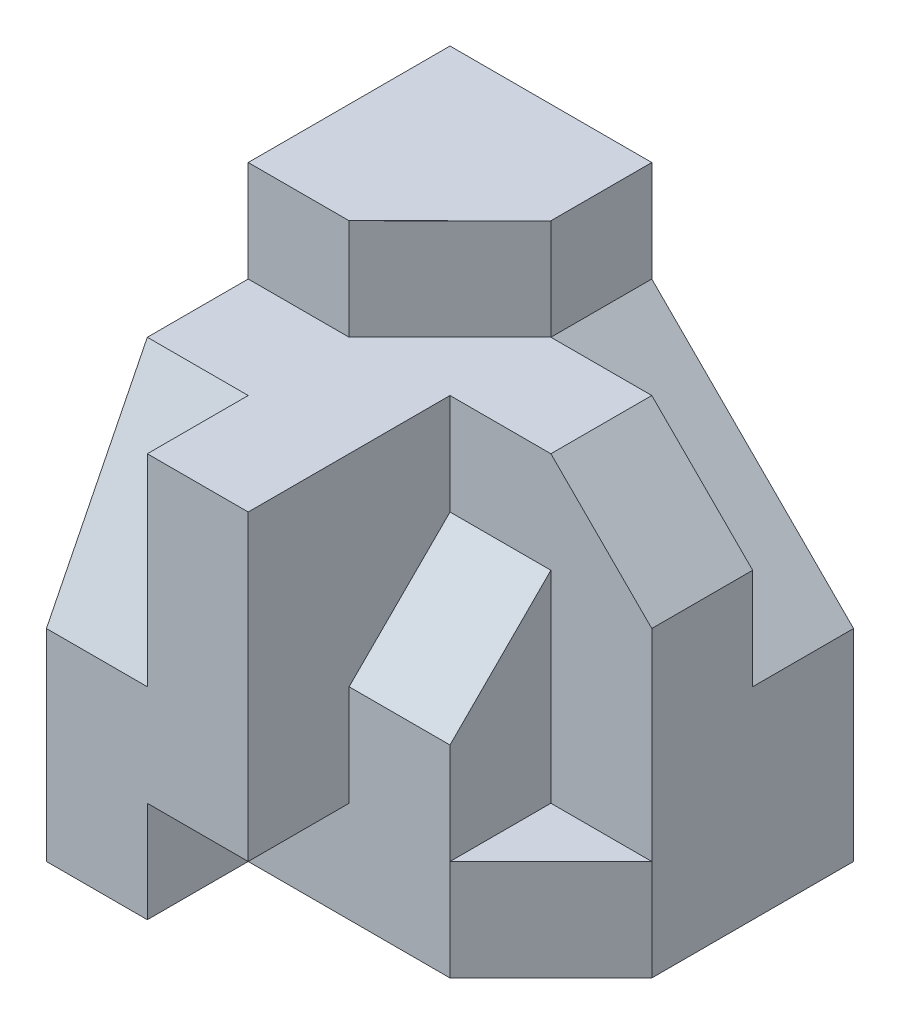
ISO-10303-21;
HEADER;
FILE_DESCRIPTION(('STEP AP214'),'2;1');
FILE_NAME('part.step','',(''),(''),'','','');
FILE_SCHEMA(('AUTOMOTIVE_DESIGN { 1 0 10303 214 1 1 1 1 }'));
ENDSEC;
DATA;
#1=APPLICATION_CONTEXT('core data for automotive mechanical design processes');
#2=APPLICATION_PROTOCOL_DEFINITION('international standard','automotive_design',2000,#1);
#3=PRODUCT_CONTEXT('',#1,'mechanical');
#4=PRODUCT('Part','Part','',(#3));
#5=PRODUCT_RELATED_PRODUCT_CATEGORY('part','',(#4));
#6=PRODUCT_DEFINITION_FORMATION('','',#4);
#7=PRODUCT_DEFINITION_CONTEXT('part definition',#1,'design');
#8=PRODUCT_DEFINITION('design','',#6,#7);
#9=PRODUCT_DEFINITION_SHAPE('','',#8);
#10=(LENGTH_UNIT() NAMED_UNIT(*) SI_UNIT(.MILLI.,.METRE.));
#11=(NAMED_UNIT(*) PLANE_ANGLE_UNIT() SI_UNIT($,.RADIAN.));
#12=(NAMED_UNIT(*) SI_UNIT($,.STERADIAN.) SOLID_ANGLE_UNIT());
#13=UNCERTAINTY_MEASURE_WITH_UNIT(LENGTH_MEASURE(1.E-05),#10,'distance_accuracy_value','');
#14=(GEOMETRIC_REPRESENTATION_CONTEXT(3) GLOBAL_UNCERTAINTY_ASSIGNED_CONTEXT((#13)) GLOBAL_UNIT_ASSIGNED_CONTEXT((#10,
#11,#12)) REPRESENTATION_CONTEXT('',''));
#15=CARTESIAN_POINT('',(0.,0.,0.));
#16=DIRECTION('',(0.,0.,1.));
#17=DIRECTION('',(1.,0.,0.));
#18=AXIS2_PLACEMENT_3D('',#15,#16,#17);
#19=CARTESIAN_POINT('',(0.,1.5,2.));
#20=DIRECTION('',(0.,1.,0.));
#21=DIRECTION('',(0.,0.,1.));
#22=AXIS2_PLACEMENT_3D('',#19,#20,#21);
#23=PLANE('',#22);
#24=DIRECTION('',(0.,0.,1.));
#25=VECTOR('',#24,1.);
#26=CARTESIAN_POINT('',(0.,1.5,3.));
#27=LINE('',#26,#25);
#28=CARTESIAN_POINT('',(0.,1.5,2.));
#29=VERTEX_POINT('',#28);
#30=CARTESIAN_POINT('',(0.,1.5,4.));
#31=VERTEX_POINT('',#30);
#32=EDGE_CURVE('E235',#29,#31,#27,.T.);
#33=ORIENTED_EDGE('',*,*,#32,.F.);
#34=DIRECTION('',(-1.,0.,0.));
#35=VECTOR('',#34,1.);
#36=CARTESIAN_POINT('',(0.,1.5,2.));
#37=LINE('',#36,#35);
#38=CARTESIAN_POINT('',(1.,1.5,2.));
#39=VERTEX_POINT('',#38);
#40=EDGE_CURVE('E217',#39,#29,#37,.T.);
#41=ORIENTED_EDGE('',*,*,#40,.F.);
#42=DIRECTION('',(0.,0.,1.));
#43=VECTOR('',#42,1.);
#44=CARTESIAN_POINT('',(1.,1.5,0.));
#45=LINE('',#44,#43);
#46=CARTESIAN_POINT('',(1.,1.5,1.));
#47=VERTEX_POINT('',#46);
#48=EDGE_CURVE('E245',#47,#39,#45,.T.);
#49=ORIENTED_EDGE('',*,*,#48,.F.);
#50=DIRECTION('',(1.,0.,0.));
#51=VECTOR('',#50,1.);
#52=CARTESIAN_POINT('',(2.,1.5,1.));
#53=LINE('',#52,#51);
#54=CARTESIAN_POINT('',(0.,1.5,1.));
#55=VERTEX_POINT('',#54);
#56=EDGE_CURVE('E267',#55,#47,#53,.T.);
#57=ORIENTED_EDGE('',*,*,#56,.F.);
#58=DIRECTION('',(0.707106781186548,0.,-0.707106781186547));
#59=VECTOR('',#58,1.);
#60=CARTESIAN_POINT('',(0.,1.5,1.));
#61=LINE('',#60,#59);
#62=CARTESIAN_POINT('',(-1.,1.5,2.));
#63=VERTEX_POINT('',#62);
#64=EDGE_CURVE('E282',#63,#55,#61,.T.);
#65=ORIENTED_EDGE('',*,*,#64,.F.);
#66=DIRECTION('',(1.,0.,0.));
#67=VECTOR('',#66,1.);
#68=CARTESIAN_POINT('',(-1.,1.5,2.));
#69=LINE('',#68,#67);
#70=CARTESIAN_POINT('',(-2.,1.5,2.));
#71=VERTEX_POINT('',#70);
#72=EDGE_CURVE('E279',#71,#63,#69,.T.);
#73=ORIENTED_EDGE('',*,*,#72,.F.);
#74=DIRECTION('',(0.,0.,1.));
#75=VECTOR('',#74,1.);
#76=CARTESIAN_POINT('',(-2.,1.5,4.));
#77=LINE('',#76,#75);
#78=CARTESIAN_POINT('',(-2.,1.5,3.));
#79=VERTEX_POINT('',#78);
#80=EDGE_CURVE('E307',#71,#79,#77,.T.);
#81=ORIENTED_EDGE('',*,*,#80,.T.);
#82=DIRECTION('',(-1.,0.,0.));
#83=VECTOR('',#82,1.);
#84=CARTESIAN_POINT('',(-1.,1.5,3.));
#85=LINE('',#84,#83);
#86=CARTESIAN_POINT('',(-1.,1.5,3.));
#87=VERTEX_POINT('',#86);
#88=EDGE_CURVE('E260',#87,#79,#85,.T.);
#89=ORIENTED_EDGE('',*,*,#88,.F.);
#90=DIRECTION('',(0.,0.,-1.));
#91=VECTOR('',#90,1.);
#92=CARTESIAN_POINT('',(-1.,1.5,4.));
#93=LINE('',#92,#91);
#94=CARTESIAN_POINT('',(-1.,1.5,4.));
#95=VERTEX_POINT('',#94);
#96=EDGE_CURVE('E255',#95,#87,#93,.T.);
#97=ORIENTED_EDGE('',*,*,#96,.F.);
#98=DIRECTION('',(-1.,0.,0.));
#99=VECTOR('',#98,1.);
#100=CARTESIAN_POINT('',(0.,1.5,4.));
#101=LINE('',#100,#99);
#102=EDGE_CURVE('E299',#31,#95,#101,.T.);
#103=ORIENTED_EDGE('',*,*,#102,.F.);
#104=EDGE_LOOP('',(#33,#41,#49,#57,#65,#73,#81,#89,#97,#103));
#105=FACE_BOUND('',#104,.T.);
#106=ADVANCED_FACE('F34',(#105),#23,.T.);
#107=CARTESIAN_POINT('',(-2.,-2.5,4.));
#108=DIRECTION('',(1.,0.,0.));
#109=DIRECTION('',(0.,0.,-1.));
#110=AXIS2_PLACEMENT_3D('',#107,#108,#109);
#111=PLANE('',#110);
#112=DIRECTION('',(0.,-1.,0.));
#113=VECTOR('',#112,1.);
#114=CARTESIAN_POINT('',(-2.,-2.5,4.));
#115=LINE('',#114,#113);
#116=CARTESIAN_POINT('',(-2.,-0.5,4.));
#117=VERTEX_POINT('',#116);
#118=CARTESIAN_POINT('',(-2.,-2.5,4.));
#119=VERTEX_POINT('',#118);
#120=EDGE_CURVE('E311',#117,#119,#115,.T.);
#121=ORIENTED_EDGE('',*,*,#120,.F.);
#122=DIRECTION('',(0.,-0.894427190999916,0.447213595499958));
#123=VECTOR('',#122,1.);
#124=CARTESIAN_POINT('',(-2.,1.5,3.));
#125=LINE('',#124,#123);
#126=EDGE_CURVE('E252',#79,#117,#125,.T.);
#127=ORIENTED_EDGE('',*,*,#126,.F.);
#128=ORIENTED_EDGE('',*,*,#80,.F.);
#129=DIRECTION('',(0.,1.,0.));
#130=VECTOR('',#129,1.);
#131=CARTESIAN_POINT('',(-2.,1.5,2.));
#132=LINE('',#131,#130);
#133=CARTESIAN_POINT('',(-2.,2.5,2.));
#134=VERTEX_POINT('',#133);
#135=EDGE_CURVE('E289',#71,#134,#132,.T.);
#136=ORIENTED_EDGE('',*,*,#135,.T.);
#137=DIRECTION('',(0.,0.,-1.));
#138=VECTOR('',#137,1.);
#139=CARTESIAN_POINT('',(-2.,2.5,4.));
#140=LINE('',#139,#138);
#141=CARTESIAN_POINT('',(-2.,2.5,0.));
#142=VERTEX_POINT('',#141);
#143=EDGE_CURVE('E317',#134,#142,#140,.T.);
#144=ORIENTED_EDGE('',*,*,#143,.T.);
#145=DIRECTION('',(0.,-1.,0.));
#146=VECTOR('',#145,1.);
#147=CARTESIAN_POINT('',(-2.,-2.5,0.));
#148=LINE('',#147,#146);
#149=CARTESIAN_POINT('',(-2.,-2.5,0.));
#150=VERTEX_POINT('',#149);
#151=EDGE_CURVE('E310',#142,#150,#148,.T.);
#152=ORIENTED_EDGE('',*,*,#151,.T.);
#153=DIRECTION('',(0.,0.,-1.));
#154=VECTOR('',#153,1.);
#155=CARTESIAN_POINT('',(-2.,-2.5,4.));
#156=LINE('',#155,#154);
#157=EDGE_CURVE('E330',#119,#150,#156,.T.);
#158=ORIENTED_EDGE('',*,*,#157,.F.);
#159=EDGE_LOOP('',(#121,#127,#128,#136,#144,#152,#158));
#160=FACE_BOUND('',#159,.T.);
#161=ADVANCED_FACE('F36',(#160),#111,.F.);
#162=CARTESIAN_POINT('',(2.,-2.5,4.));
#163=DIRECTION('',(-1.,0.,0.));
#164=DIRECTION('',(0.,0.,1.));
#165=AXIS2_PLACEMENT_3D('',#162,#163,#164);
#166=PLANE('',#165);
#167=DIRECTION('',(0.,1.,0.));
#168=VECTOR('',#167,1.);
#169=CARTESIAN_POINT('',(2.,-1.5,2.));
#170=LINE('',#169,#168);
#171=CARTESIAN_POINT('',(2.,-1.5,2.));
#172=VERTEX_POINT('',#171);
#173=CARTESIAN_POINT('',(2.,0.5,2.));
#174=VERTEX_POINT('',#173);
#175=EDGE_CURVE('E206',#172,#174,#170,.T.);
#176=ORIENTED_EDGE('',*,*,#175,.F.);
#177=DIRECTION('',(0.,1.,0.));
#178=VECTOR('',#177,1.);
#179=CARTESIAN_POINT('',(2.,-4.5,2.));
#180=LINE('',#179,#178);
#181=CARTESIAN_POINT('',(2.,-2.5,2.));
#182=VERTEX_POINT('',#181);
#183=EDGE_CURVE('E178',#182,#172,#180,.T.);
#184=ORIENTED_EDGE('',*,*,#183,.F.);
#185=DIRECTION('',(0.,0.,-1.));
#186=VECTOR('',#185,1.);
#187=CARTESIAN_POINT('',(2.,-2.5,4.));
#188=LINE('',#187,#186);
#189=CARTESIAN_POINT('',(2.,-2.5,0.));
#190=VERTEX_POINT('',#189);
#191=EDGE_CURVE('E328',#182,#190,#188,.T.);
#192=ORIENTED_EDGE('',*,*,#191,.T.);
#193=DIRECTION('',(0.,1.,0.));
#194=VECTOR('',#193,1.);
#195=CARTESIAN_POINT('',(2.,-2.5,0.));
#196=LINE('',#195,#194);
#197=CARTESIAN_POINT('',(2.,-0.5,0.));
#198=VERTEX_POINT('',#197);
#199=EDGE_CURVE('E322',#190,#198,#196,.T.);
#200=ORIENTED_EDGE('',*,*,#199,.T.);
#201=DIRECTION('',(0.,0.,-1.));
#202=VECTOR('',#201,1.);
#203=CARTESIAN_POINT('',(2.,-0.5,1.));
#204=LINE('',#203,#202);
#205=CARTESIAN_POINT('',(2.,-0.5,1.));
#206=VERTEX_POINT('',#205);
#207=EDGE_CURVE('E275',#206,#198,#204,.T.);
#208=ORIENTED_EDGE('',*,*,#207,.F.);
#209=DIRECTION('',(0.,-1.,0.));
#210=VECTOR('',#209,1.);
#211=CARTESIAN_POINT('',(2.,-0.5,1.));
#212=LINE('',#211,#210);
#213=CARTESIAN_POINT('',(2.,0.500000000000001,1.));
#214=VERTEX_POINT('',#213);
#215=EDGE_CURVE('E270',#214,#206,#212,.T.);
#216=ORIENTED_EDGE('',*,*,#215,.F.);
#217=DIRECTION('',(0.,0.,1.));
#218=VECTOR('',#217,1.);
#219=CARTESIAN_POINT('',(2.,0.5,0.));
#220=LINE('',#219,#218);
#221=EDGE_CURVE('E49',#214,#174,#220,.T.);
#222=ORIENTED_EDGE('',*,*,#221,.T.);
#223=EDGE_LOOP('',(#176,#184,#192,#200,#208,#216,#222));
#224=FACE_BOUND('',#223,.T.);
#225=ADVANCED_FACE('F341',(#224),#166,.F.);
#226=CARTESIAN_POINT('',(2.,2.5,4.));
#227=DIRECTION('',(0.,-1.,0.));
#228=DIRECTION('',(0.,0.,-1.));
#229=AXIS2_PLACEMENT_3D('',#226,#227,#228);
#230=PLANE('',#229);
#231=DIRECTION('',(0.,0.,-1.));
#232=VECTOR('',#231,1.);
#233=CARTESIAN_POINT('',(0.,2.5,0.));
#234=LINE('',#233,#232);
#235=CARTESIAN_POINT('',(0.,2.5,1.));
#236=VERTEX_POINT('',#235);
#237=CARTESIAN_POINT('',(0.,2.5,0.));
#238=VERTEX_POINT('',#237);
#239=EDGE_CURVE('E283',#236,#238,#234,.T.);
#240=ORIENTED_EDGE('',*,*,#239,.T.);
#241=DIRECTION('',(-1.,0.,0.));
#242=VECTOR('',#241,1.);
#243=CARTESIAN_POINT('',(2.,2.5,0.));
#244=LINE('',#243,#242);
#245=EDGE_CURVE('E314',#238,#142,#244,.T.);
#246=ORIENTED_EDGE('',*,*,#245,.T.);
#247=ORIENTED_EDGE('',*,*,#143,.F.);
#248=DIRECTION('',(1.,0.,0.));
#249=VECTOR('',#248,1.);
#250=CARTESIAN_POINT('',(-1.,2.5,2.));
#251=LINE('',#250,#249);
#252=CARTESIAN_POINT('',(-1.,2.5,2.));
#253=VERTEX_POINT('',#252);
#254=EDGE_CURVE('E278',#134,#253,#251,.T.);
#255=ORIENTED_EDGE('',*,*,#254,.T.);
#256=DIRECTION('',(0.707106781186548,0.,-0.707106781186547));
#257=VECTOR('',#256,1.);
#258=CARTESIAN_POINT('',(0.,2.5,1.));
#259=LINE('',#258,#257);
#260=EDGE_CURVE('E292',#253,#236,#259,.T.);
#261=ORIENTED_EDGE('',*,*,#260,.T.);
#262=EDGE_LOOP('',(#240,#246,#247,#255,#261));
#263=FACE_BOUND('',#262,.T.);
#264=ADVANCED_FACE('F363',(#263),#230,.F.);
#265=CARTESIAN_POINT('',(0.,0.,4.));
#266=DIRECTION('',(0.,0.,1.));
#267=DIRECTION('',(1.,0.,0.));
#268=AXIS2_PLACEMENT_3D('',#265,#266,#267);
#269=PLANE('',#268);
#270=DIRECTION('',(0.,-1.,0.));
#271=VECTOR('',#270,1.);
#272=CARTESIAN_POINT('',(-1.,-2.5,4.));
#273=LINE('',#272,#271);
#274=CARTESIAN_POINT('',(-1.,-1.5,4.));
#275=VERTEX_POINT('',#274);
#276=CARTESIAN_POINT('',(-1.,-2.5,4.));
#277=VERTEX_POINT('',#276);
#278=EDGE_CURVE('E228',#275,#277,#273,.T.);
#279=ORIENTED_EDGE('',*,*,#278,.F.);
#280=DIRECTION('',(-1.,0.,0.));
#281=VECTOR('',#280,1.);
#282=CARTESIAN_POINT('',(-1.,-1.5,4.));
#283=LINE('',#282,#281);
#284=CARTESIAN_POINT('',(0.,-1.5,4.));
#285=VERTEX_POINT('',#284);
#286=EDGE_CURVE('E238',#285,#275,#283,.T.);
#287=ORIENTED_EDGE('',*,*,#286,.F.);
#288=DIRECTION('',(0.,-1.,0.));
#289=VECTOR('',#288,1.);
#290=CARTESIAN_POINT('',(0.,-1.5,4.));
#291=LINE('',#290,#289);
#292=EDGE_CURVE('E225',#31,#285,#291,.T.);
#293=ORIENTED_EDGE('',*,*,#292,.F.);
#294=ORIENTED_EDGE('',*,*,#102,.T.);
#295=DIRECTION('',(0.,1.,0.));
#296=VECTOR('',#295,1.);
#297=CARTESIAN_POINT('',(-1.,-0.5,4.));
#298=LINE('',#297,#296);
#299=CARTESIAN_POINT('',(-1.,-0.5,4.));
#300=VERTEX_POINT('',#299);
#301=EDGE_CURVE('E258',#300,#95,#298,.T.);
#302=ORIENTED_EDGE('',*,*,#301,.F.);
#303=DIRECTION('',(-1.,0.,0.));
#304=VECTOR('',#303,1.);
#305=CARTESIAN_POINT('',(-1.,-0.5,4.));
#306=LINE('',#305,#304);
#307=EDGE_CURVE('E262',#300,#117,#306,.T.);
#308=ORIENTED_EDGE('',*,*,#307,.T.);
#309=ORIENTED_EDGE('',*,*,#120,.T.);
#310=DIRECTION('',(1.,0.,0.));
#311=VECTOR('',#310,1.);
#312=CARTESIAN_POINT('',(2.,-2.5,4.));
#313=LINE('',#312,#311);
#314=EDGE_CURVE('E313',#119,#277,#313,.T.);
#315=ORIENTED_EDGE('',*,*,#314,.T.);
#316=EDGE_LOOP('',(#279,#287,#293,#294,#302,#308,#309,#315));
#317=FACE_BOUND('',#316,.T.);
#318=ADVANCED_FACE('F385',(#317),#269,.T.);
#319=CARTESIAN_POINT('',(2.,-2.5,4.));
#320=DIRECTION('',(0.,1.,0.));
#321=DIRECTION('',(-1.,0.,0.));
#322=AXIS2_PLACEMENT_3D('',#319,#320,#321);
#323=PLANE('',#322);
#324=ORIENTED_EDGE('',*,*,#191,.F.);
#325=DIRECTION('',(-0.707106781186548,0.,0.707106781186548));
#326=VECTOR('',#325,1.);
#327=CARTESIAN_POINT('',(1.,-2.5,3.));
#328=LINE('',#327,#326);
#329=CARTESIAN_POINT('',(1.,-2.5,3.));
#330=VERTEX_POINT('',#329);
#331=EDGE_CURVE('E195',#182,#330,#328,.T.);
#332=ORIENTED_EDGE('',*,*,#331,.T.);
#333=DIRECTION('',(1.,0.,0.));
#334=VECTOR('',#333,1.);
#335=CARTESIAN_POINT('',(2.,-2.5,3.));
#336=LINE('',#335,#334);
#337=CARTESIAN_POINT('',(-1.,-2.5,3.));
#338=VERTEX_POINT('',#337);
#339=EDGE_CURVE('E194',#338,#330,#336,.T.);
#340=ORIENTED_EDGE('',*,*,#339,.F.);
#341=DIRECTION('',(0.,0.,1.));
#342=VECTOR('',#341,1.);
#343=CARTESIAN_POINT('',(-1.,-2.5,3.));
#344=LINE('',#343,#342);
#345=EDGE_CURVE('E242',#338,#277,#344,.T.);
#346=ORIENTED_EDGE('',*,*,#345,.T.);
#347=ORIENTED_EDGE('',*,*,#314,.F.);
#348=ORIENTED_EDGE('',*,*,#157,.T.);
#349=DIRECTION('',(1.,0.,0.));
#350=VECTOR('',#349,1.);
#351=CARTESIAN_POINT('',(2.,-2.5,0.));
#352=LINE('',#351,#350);
#353=EDGE_CURVE('E319',#150,#190,#352,.T.);
#354=ORIENTED_EDGE('',*,*,#353,.T.);
#355=EDGE_LOOP('',(#324,#332,#340,#346,#347,#348,#354));
#356=FACE_BOUND('',#355,.T.);
#357=ADVANCED_FACE('F405',(#356),#323,.F.);
#358=CARTESIAN_POINT('',(0.,0.,0.));
#359=DIRECTION('',(0.,0.,1.));
#360=DIRECTION('',(1.,0.,0.));
#361=AXIS2_PLACEMENT_3D('',#358,#359,#360);
#362=PLANE('',#361);
#363=DIRECTION('',(0.,1.,0.));
#364=VECTOR('',#363,1.);
#365=CARTESIAN_POINT('',(0.,1.5,0.));
#366=LINE('',#365,#364);
#367=CARTESIAN_POINT('',(0.,1.5,0.));
#368=VERTEX_POINT('',#367);
#369=EDGE_CURVE('E297',#368,#238,#366,.T.);
#370=ORIENTED_EDGE('',*,*,#369,.F.);
#371=DIRECTION('',(-0.707106781186548,0.707106781186548,0.));
#372=VECTOR('',#371,1.);
#373=CARTESIAN_POINT('',(0.,1.5,0.));
#374=LINE('',#373,#372);
#375=EDGE_CURVE('E265',#198,#368,#374,.T.);
#376=ORIENTED_EDGE('',*,*,#375,.F.);
#377=ORIENTED_EDGE('',*,*,#199,.F.);
#378=ORIENTED_EDGE('',*,*,#353,.F.);
#379=ORIENTED_EDGE('',*,*,#151,.F.);
#380=ORIENTED_EDGE('',*,*,#245,.F.);
#381=EDGE_LOOP('',(#370,#376,#377,#378,#379,#380));
#382=FACE_BOUND('',#381,.T.);
#383=ADVANCED_FACE('F357',(#382),#362,.F.);
#384=CARTESIAN_POINT('',(0.,1.5,0.));
#385=DIRECTION('',(1.,0.,0.));
#386=DIRECTION('',(0.,0.,-1.));
#387=AXIS2_PLACEMENT_3D('',#384,#385,#386);
#388=PLANE('',#387);
#389=ORIENTED_EDGE('',*,*,#239,.F.);
#390=DIRECTION('',(0.,1.,0.));
#391=VECTOR('',#390,1.);
#392=CARTESIAN_POINT('',(0.,1.5,1.));
#393=LINE('',#392,#391);
#394=EDGE_CURVE('E300',#55,#236,#393,.T.);
#395=ORIENTED_EDGE('',*,*,#394,.F.);
#396=DIRECTION('',(0.,0.,-1.));
#397=VECTOR('',#396,1.);
#398=CARTESIAN_POINT('',(0.,1.5,0.));
#399=LINE('',#398,#397);
#400=EDGE_CURVE('E286',#55,#368,#399,.T.);
#401=ORIENTED_EDGE('',*,*,#400,.T.);
#402=ORIENTED_EDGE('',*,*,#369,.T.);
#403=EDGE_LOOP('',(#389,#395,#401,#402));
#404=FACE_BOUND('',#403,.T.);
#405=ADVANCED_FACE('F354',(#404),#388,.T.);
#406=CARTESIAN_POINT('',(0.,1.5,1.));
#407=DIRECTION('',(0.707106781186547,0.,0.707106781186548));
#408=DIRECTION('',(0.707106781186548,0.,-0.707106781186547));
#409=AXIS2_PLACEMENT_3D('',#406,#407,#408);
#410=PLANE('',#409);
#411=ORIENTED_EDGE('',*,*,#260,.F.);
#412=DIRECTION('',(0.,1.,0.));
#413=VECTOR('',#412,1.);
#414=CARTESIAN_POINT('',(-1.,1.5,2.));
#415=LINE('',#414,#413);
#416=EDGE_CURVE('E302',#63,#253,#415,.T.);
#417=ORIENTED_EDGE('',*,*,#416,.F.);
#418=ORIENTED_EDGE('',*,*,#64,.T.);
#419=ORIENTED_EDGE('',*,*,#394,.T.);
#420=EDGE_LOOP('',(#411,#417,#418,#419));
#421=FACE_BOUND('',#420,.T.);
#422=ADVANCED_FACE('F366',(#421),#410,.T.);
#423=CARTESIAN_POINT('',(-1.,1.5,2.));
#424=DIRECTION('',(0.,0.,1.));
#425=DIRECTION('',(1.,0.,0.));
#426=AXIS2_PLACEMENT_3D('',#423,#424,#425);
#427=PLANE('',#426);
#428=ORIENTED_EDGE('',*,*,#254,.F.);
#429=ORIENTED_EDGE('',*,*,#135,.F.);
#430=ORIENTED_EDGE('',*,*,#72,.T.);
#431=ORIENTED_EDGE('',*,*,#416,.T.);
#432=EDGE_LOOP('',(#428,#429,#430,#431));
#433=FACE_BOUND('',#432,.T.);
#434=ADVANCED_FACE('F371',(#433),#427,.T.);
#435=CARTESIAN_POINT('',(0.,1.5,1.));
#436=DIRECTION('',(-0.707106781186547,-0.707106781186547,0.));
#437=DIRECTION('',(0.707106781186548,-0.707106781186548,0.));
#438=AXIS2_PLACEMENT_3D('',#435,#436,#437);
#439=PLANE('',#438);
#440=ORIENTED_EDGE('',*,*,#375,.T.);
#441=ORIENTED_EDGE('',*,*,#400,.F.);
#442=DIRECTION('',(-0.707106781186548,0.707106781186548,0.));
#443=VECTOR('',#442,1.);
#444=CARTESIAN_POINT('',(0.,1.5,1.));
#445=LINE('',#444,#443);
#446=EDGE_CURVE('E272',#206,#55,#445,.T.);
#447=ORIENTED_EDGE('',*,*,#446,.F.);
#448=ORIENTED_EDGE('',*,*,#207,.T.);
#449=EDGE_LOOP('',(#440,#441,#447,#448));
#450=FACE_BOUND('',#449,.T.);
#451=ADVANCED_FACE('F348',(#450),#439,.F.);
#452=CARTESIAN_POINT('',(0.,0.,1.));
#453=DIRECTION('',(0.,0.,-1.));
#454=DIRECTION('',(-1.,0.,0.));
#455=AXIS2_PLACEMENT_3D('',#452,#453,#454);
#456=PLANE('',#455);
#457=DIRECTION('',(-0.707106781186547,0.707106781186548,0.));
#458=VECTOR('',#457,1.);
#459=CARTESIAN_POINT('',(1.25,1.25,1.));
#460=LINE('',#459,#458);
#461=EDGE_CURVE('E333',#214,#47,#460,.T.);
#462=ORIENTED_EDGE('',*,*,#461,.F.);
#463=ORIENTED_EDGE('',*,*,#215,.T.);
#464=ORIENTED_EDGE('',*,*,#446,.T.);
#465=ORIENTED_EDGE('',*,*,#56,.T.);
#466=EDGE_LOOP('',(#462,#463,#464,#465));
#467=FACE_BOUND('',#466,.T.);
#468=ADVANCED_FACE('F345',(#467),#456,.T.);
#469=CARTESIAN_POINT('',(-1.,1.5,3.));
#470=DIRECTION('',(0.,-0.447213595499958,-0.894427190999916));
#471=DIRECTION('',(0.,0.894427190999916,-0.447213595499958));
#472=AXIS2_PLACEMENT_3D('',#469,#470,#471);
#473=PLANE('',#472);
#474=ORIENTED_EDGE('',*,*,#126,.T.);
#475=ORIENTED_EDGE('',*,*,#307,.F.);
#476=DIRECTION('',(0.,-0.894427190999916,0.447213595499958));
#477=VECTOR('',#476,1.);
#478=CARTESIAN_POINT('',(-1.,1.5,3.));
#479=LINE('',#478,#477);
#480=EDGE_CURVE('E57',#87,#300,#479,.T.);
#481=ORIENTED_EDGE('',*,*,#480,.F.);
#482=ORIENTED_EDGE('',*,*,#88,.T.);
#483=EDGE_LOOP('',(#474,#475,#481,#482));
#484=FACE_BOUND('',#483,.T.);
#485=ADVANCED_FACE('F380',(#484),#473,.F.);
#486=CARTESIAN_POINT('',(-1.,0.,0.));
#487=DIRECTION('',(1.,0.,0.));
#488=DIRECTION('',(0.,0.,-1.));
#489=AXIS2_PLACEMENT_3D('',#486,#487,#488);
#490=PLANE('',#489);
#491=ORIENTED_EDGE('',*,*,#96,.T.);
#492=ORIENTED_EDGE('',*,*,#480,.T.);
#493=ORIENTED_EDGE('',*,*,#301,.T.);
#494=EDGE_LOOP('',(#491,#492,#493));
#495=FACE_BOUND('',#494,.T.);
#496=ADVANCED_FACE('F382',(#495),#490,.F.);
#497=CARTESIAN_POINT('',(1.,1.5,0.));
#498=DIRECTION('',(-0.707106781186548,-0.707106781186547,0.));
#499=DIRECTION('',(0.707106781186547,-0.707106781186548,0.));
#500=AXIS2_PLACEMENT_3D('',#497,#498,#499);
#501=PLANE('',#500);
#502=ORIENTED_EDGE('',*,*,#48,.T.);
#503=DIRECTION('',(0.707106781186547,-0.707106781186548,0.));
#504=VECTOR('',#503,1.);
#505=CARTESIAN_POINT('',(1.,1.5,2.));
#506=LINE('',#505,#504);
#507=EDGE_CURVE('E42',#39,#174,#506,.T.);
#508=ORIENTED_EDGE('',*,*,#507,.T.);
#509=ORIENTED_EDGE('',*,*,#221,.F.);
#510=ORIENTED_EDGE('',*,*,#461,.T.);
#511=EDGE_LOOP('',(#502,#508,#509,#510));
#512=FACE_BOUND('',#511,.T.);
#513=ADVANCED_FACE('F334',(#512),#501,.F.);
#514=CARTESIAN_POINT('',(-1.,-2.5,3.));
#515=DIRECTION('',(-1.,0.,0.));
#516=DIRECTION('',(0.,0.,1.));
#517=AXIS2_PLACEMENT_3D('',#514,#515,#516);
#518=PLANE('',#517);
#519=ORIENTED_EDGE('',*,*,#278,.T.);
#520=ORIENTED_EDGE('',*,*,#345,.F.);
#521=DIRECTION('',(0.,-1.,0.));
#522=VECTOR('',#521,1.);
#523=CARTESIAN_POINT('',(-1.,-2.5,3.));
#524=LINE('',#523,#522);
#525=CARTESIAN_POINT('',(-1.,-1.5,3.));
#526=VERTEX_POINT('',#525);
#527=EDGE_CURVE('E233',#526,#338,#524,.T.);
#528=ORIENTED_EDGE('',*,*,#527,.F.);
#529=DIRECTION('',(0.,0.,1.));
#530=VECTOR('',#529,1.);
#531=CARTESIAN_POINT('',(-1.,-1.5,3.));
#532=LINE('',#531,#530);
#533=EDGE_CURVE('E246',#526,#275,#532,.T.);
#534=ORIENTED_EDGE('',*,*,#533,.T.);
#535=EDGE_LOOP('',(#519,#520,#528,#534));
#536=FACE_BOUND('',#535,.T.);
#537=ADVANCED_FACE('F402',(#536),#518,.F.);
#538=CARTESIAN_POINT('',(-1.,-1.5,3.));
#539=DIRECTION('',(0.,1.,0.));
#540=DIRECTION('',(0.,0.,1.));
#541=AXIS2_PLACEMENT_3D('',#538,#539,#540);
#542=PLANE('',#541);
#543=ORIENTED_EDGE('',*,*,#286,.T.);
#544=ORIENTED_EDGE('',*,*,#533,.F.);
#545=DIRECTION('',(-1.,0.,0.));
#546=VECTOR('',#545,1.);
#547=CARTESIAN_POINT('',(-1.,-1.5,3.));
#548=LINE('',#547,#546);
#549=CARTESIAN_POINT('',(0.,-1.5,3.));
#550=VERTEX_POINT('',#549);
#551=EDGE_CURVE('E230',#550,#526,#548,.T.);
#552=ORIENTED_EDGE('',*,*,#551,.F.);
#553=DIRECTION('',(0.,0.,1.));
#554=VECTOR('',#553,1.);
#555=CARTESIAN_POINT('',(0.,-1.5,3.));
#556=LINE('',#555,#554);
#557=EDGE_CURVE('E248',#550,#285,#556,.T.);
#558=ORIENTED_EDGE('',*,*,#557,.T.);
#559=EDGE_LOOP('',(#543,#544,#552,#558));
#560=FACE_BOUND('',#559,.T.);
#561=ADVANCED_FACE('F400',(#560),#542,.F.);
#562=CARTESIAN_POINT('',(0.,-1.5,3.));
#563=DIRECTION('',(-1.,0.,0.));
#564=DIRECTION('',(0.,0.,1.));
#565=AXIS2_PLACEMENT_3D('',#562,#563,#564);
#566=PLANE('',#565);
#567=DIRECTION('',(0.,-1.,0.));
#568=VECTOR('',#567,1.);
#569=CARTESIAN_POINT('',(0.,-1.5,3.));
#570=LINE('',#569,#568);
#571=CARTESIAN_POINT('',(0.,-0.5,3.));
#572=VERTEX_POINT('',#571);
#573=EDGE_CURVE('E227',#572,#550,#570,.T.);
#574=ORIENTED_EDGE('',*,*,#573,.F.);
#575=DIRECTION('',(0.,0.707106781186548,-0.707106781186547));
#576=VECTOR('',#575,1.);
#577=CARTESIAN_POINT('',(0.,0.5,2.));
#578=LINE('',#577,#576);
#579=CARTESIAN_POINT('',(0.,0.5,2.));
#580=VERTEX_POINT('',#579);
#581=EDGE_CURVE('E201',#572,#580,#578,.T.);
#582=ORIENTED_EDGE('',*,*,#581,.T.);
#583=DIRECTION('',(0.,1.,0.));
#584=VECTOR('',#583,1.);
#585=CARTESIAN_POINT('',(0.,0.5,2.));
#586=LINE('',#585,#584);
#587=EDGE_CURVE('E220',#580,#29,#586,.T.);
#588=ORIENTED_EDGE('',*,*,#587,.T.);
#589=ORIENTED_EDGE('',*,*,#32,.T.);
#590=ORIENTED_EDGE('',*,*,#292,.T.);
#591=ORIENTED_EDGE('',*,*,#557,.F.);
#592=EDGE_LOOP('',(#574,#582,#588,#589,#590,#591));
#593=FACE_BOUND('',#592,.T.);
#594=ADVANCED_FACE('F393',(#593),#566,.F.);
#595=CARTESIAN_POINT('',(0.,0.,3.));
#596=DIRECTION('',(0.,0.,-1.));
#597=DIRECTION('',(-1.,0.,0.));
#598=AXIS2_PLACEMENT_3D('',#595,#596,#597);
#599=PLANE('',#598);
#600=ORIENTED_EDGE('',*,*,#339,.T.);
#601=DIRECTION('',(0.,1.,0.));
#602=VECTOR('',#601,1.);
#603=CARTESIAN_POINT('',(1.,-4.5,3.));
#604=LINE('',#603,#602);
#605=CARTESIAN_POINT('',(1.,-1.5,3.));
#606=VERTEX_POINT('',#605);
#607=EDGE_CURVE('E175',#330,#606,#604,.T.);
#608=ORIENTED_EDGE('',*,*,#607,.T.);
#609=DIRECTION('',(0.,1.,0.));
#610=VECTOR('',#609,1.);
#611=CARTESIAN_POINT('',(1.,-1.5,3.));
#612=LINE('',#611,#610);
#613=CARTESIAN_POINT('',(1.,-0.5,3.));
#614=VERTEX_POINT('',#613);
#615=EDGE_CURVE('E190',#606,#614,#612,.T.);
#616=ORIENTED_EDGE('',*,*,#615,.T.);
#617=DIRECTION('',(1.,0.,0.));
#618=VECTOR('',#617,1.);
#619=CARTESIAN_POINT('',(0.,-0.5,3.));
#620=LINE('',#619,#618);
#621=EDGE_CURVE('E215',#572,#614,#620,.T.);
#622=ORIENTED_EDGE('',*,*,#621,.F.);
#623=ORIENTED_EDGE('',*,*,#573,.T.);
#624=ORIENTED_EDGE('',*,*,#551,.T.);
#625=ORIENTED_EDGE('',*,*,#527,.T.);
#626=EDGE_LOOP('',(#600,#608,#616,#622,#623,#624,#625));
#627=FACE_BOUND('',#626,.T.);
#628=ADVANCED_FACE('F188',(#627),#599,.F.);
#629=CARTESIAN_POINT('',(0.,0.5,2.));
#630=DIRECTION('',(0.,0.,-1.));
#631=DIRECTION('',(-1.,0.,0.));
#632=AXIS2_PLACEMENT_3D('',#629,#630,#631);
#633=PLANE('',#632);
#634=DIRECTION('',(-1.,0.,0.));
#635=VECTOR('',#634,1.);
#636=CARTESIAN_POINT('',(0.,0.5,2.));
#637=LINE('',#636,#635);
#638=CARTESIAN_POINT('',(1.,0.5,2.));
#639=VERTEX_POINT('',#638);
#640=EDGE_CURVE('E218',#639,#580,#637,.T.);
#641=ORIENTED_EDGE('',*,*,#640,.F.);
#642=DIRECTION('',(0.,1.,0.));
#643=VECTOR('',#642,1.);
#644=CARTESIAN_POINT('',(1.,-1.5,2.));
#645=LINE('',#644,#643);
#646=CARTESIAN_POINT('',(1.,-1.5,2.));
#647=VERTEX_POINT('',#646);
#648=EDGE_CURVE('E202',#647,#639,#645,.T.);
#649=ORIENTED_EDGE('',*,*,#648,.F.);
#650=DIRECTION('',(-1.,0.,0.));
#651=VECTOR('',#650,1.);
#652=CARTESIAN_POINT('',(2.,-1.5,2.));
#653=LINE('',#652,#651);
#654=EDGE_CURVE('E205',#172,#647,#653,.T.);
#655=ORIENTED_EDGE('',*,*,#654,.F.);
#656=ORIENTED_EDGE('',*,*,#175,.T.);
#657=ORIENTED_EDGE('',*,*,#507,.F.);
#658=ORIENTED_EDGE('',*,*,#40,.T.);
#659=ORIENTED_EDGE('',*,*,#587,.F.);
#660=EDGE_LOOP('',(#641,#649,#655,#656,#657,#658,#659));
#661=FACE_BOUND('',#660,.T.);
#662=ADVANCED_FACE('F391',(#661),#633,.F.);
#663=CARTESIAN_POINT('',(0.,0.5,2.));
#664=DIRECTION('',(0.,-0.707106781186547,-0.707106781186548));
#665=DIRECTION('',(0.,0.707106781186548,-0.707106781186547));
#666=AXIS2_PLACEMENT_3D('',#663,#664,#665);
#667=PLANE('',#666);
#668=ORIENTED_EDGE('',*,*,#621,.T.);
#669=DIRECTION('',(0.,0.707106781186548,-0.707106781186547));
#670=VECTOR('',#669,1.);
#671=CARTESIAN_POINT('',(1.,0.500000000000001,2.));
#672=LINE('',#671,#670);
#673=EDGE_CURVE('E12',#614,#639,#672,.T.);
#674=ORIENTED_EDGE('',*,*,#673,.T.);
#675=ORIENTED_EDGE('',*,*,#640,.T.);
#676=ORIENTED_EDGE('',*,*,#581,.F.);
#677=EDGE_LOOP('',(#668,#674,#675,#676));
#678=FACE_BOUND('',#677,.T.);
#679=ADVANCED_FACE('F396',(#678),#667,.F.);
#680=CARTESIAN_POINT('',(1.,-1.5,2.));
#681=DIRECTION('',(-1.,0.,0.));
#682=DIRECTION('',(0.,0.,1.));
#683=AXIS2_PLACEMENT_3D('',#680,#681,#682);
#684=PLANE('',#683);
#685=ORIENTED_EDGE('',*,*,#615,.F.);
#686=DIRECTION('',(0.,0.,1.));
#687=VECTOR('',#686,1.);
#688=CARTESIAN_POINT('',(1.,-1.5,2.));
#689=LINE('',#688,#687);
#690=EDGE_CURVE('E200',#647,#606,#689,.T.);
#691=ORIENTED_EDGE('',*,*,#690,.F.);
#692=ORIENTED_EDGE('',*,*,#648,.T.);
#693=ORIENTED_EDGE('',*,*,#673,.F.);
#694=EDGE_LOOP('',(#685,#691,#692,#693));
#695=FACE_BOUND('',#694,.T.);
#696=ADVANCED_FACE('F199',(#695),#684,.F.);
#697=CARTESIAN_POINT('',(0.,-1.5,0.));
#698=DIRECTION('',(0.,1.,0.));
#699=DIRECTION('',(0.,0.,1.));
#700=AXIS2_PLACEMENT_3D('',#697,#698,#699);
#701=PLANE('',#700);
#702=DIRECTION('',(-0.707106781186548,0.,0.707106781186548));
#703=VECTOR('',#702,1.);
#704=CARTESIAN_POINT('',(2.,-1.5,2.));
#705=LINE('',#704,#703);
#706=EDGE_CURVE('E172',#172,#606,#705,.T.);
#707=ORIENTED_EDGE('',*,*,#706,.F.);
#708=ORIENTED_EDGE('',*,*,#654,.T.);
#709=ORIENTED_EDGE('',*,*,#690,.T.);
#710=EDGE_LOOP('',(#707,#708,#709));
#711=FACE_BOUND('',#710,.T.);
#712=ADVANCED_FACE('F204',(#711),#701,.T.);
#713=CARTESIAN_POINT('',(2.,-4.5,2.));
#714=DIRECTION('',(-0.707106781186547,0.,-0.707106781186547));
#715=DIRECTION('',(-0.707106781186548,0.,0.707106781186548));
#716=AXIS2_PLACEMENT_3D('',#713,#714,#715);
#717=PLANE('',#716);
#718=ORIENTED_EDGE('',*,*,#183,.T.);
#719=ORIENTED_EDGE('',*,*,#706,.T.);
#720=ORIENTED_EDGE('',*,*,#607,.F.);
#721=ORIENTED_EDGE('',*,*,#331,.F.);
#722=EDGE_LOOP('',(#718,#719,#720,#721));
#723=FACE_BOUND('',#722,.T.);
#724=ADVANCED_FACE('F174',(#723),#717,.F.);
#725=CLOSED_SHELL('',(#106,#161,#225,#264,#318,#357,#383,#405,#422,#434,#451,#468,#485,#496,
#513,#537,#561,#594,#628,#662,#679,#696,#712,#724));
#726=MANIFOLD_SOLID_BREP('B2',#725);
#727=ADVANCED_BREP_SHAPE_REPRESENTATION('',(#18,#726),#14);
#728=SHAPE_DEFINITION_REPRESENTATION(#9,#727);
ENDSEC;
END-ISO-10303-21;
